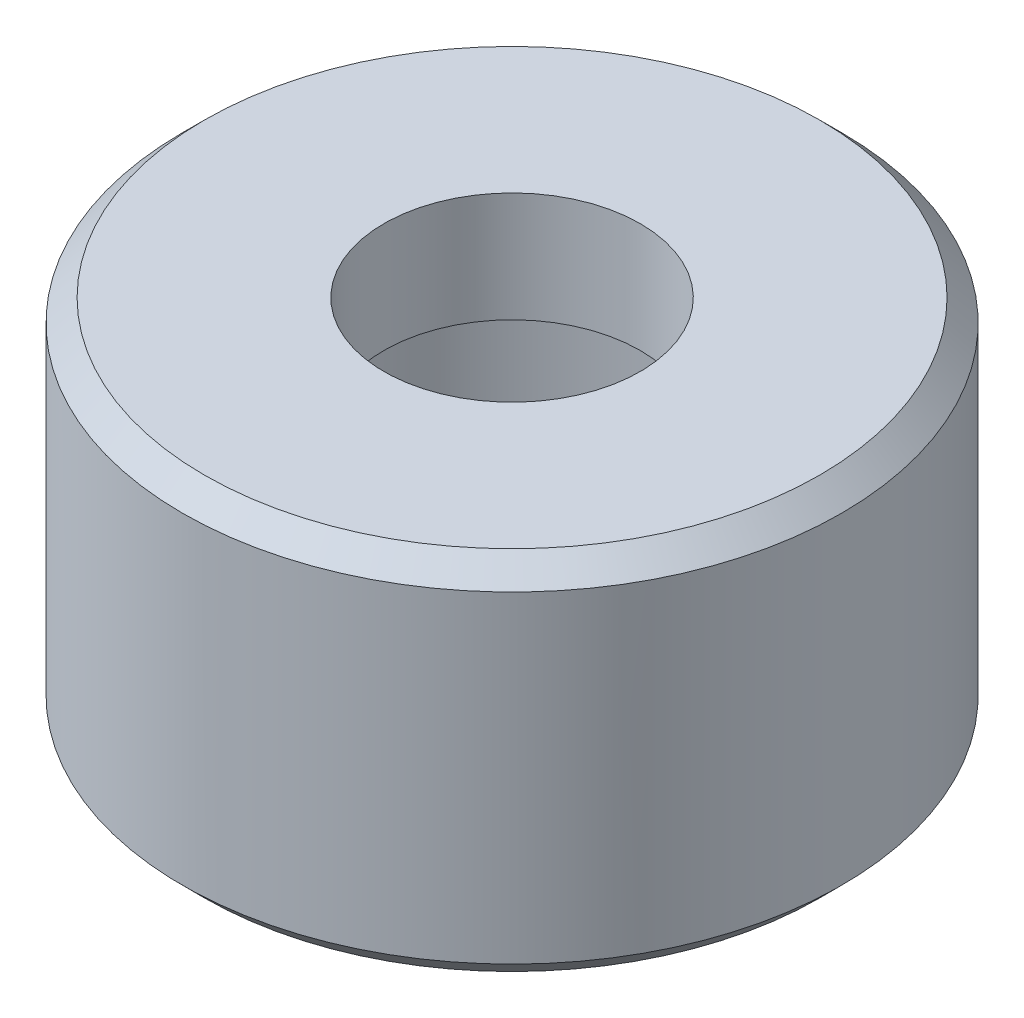
ISO-10303-21;
HEADER;
FILE_DESCRIPTION(('STEP AP214'),'2;1');
FILE_NAME('part.step','',(''),(''),'','','');
FILE_SCHEMA(('AUTOMOTIVE_DESIGN { 1 0 10303 214 1 1 1 1 }'));
ENDSEC;
DATA;
#1=APPLICATION_CONTEXT('core data for automotive mechanical design processes');
#2=APPLICATION_PROTOCOL_DEFINITION('international standard','automotive_design',2000,#1);
#3=PRODUCT_CONTEXT('',#1,'mechanical');
#4=PRODUCT('Part','Part','',(#3));
#5=PRODUCT_RELATED_PRODUCT_CATEGORY('part','',(#4));
#6=PRODUCT_DEFINITION_FORMATION('','',#4);
#7=PRODUCT_DEFINITION_CONTEXT('part definition',#1,'design');
#8=PRODUCT_DEFINITION('design','',#6,#7);
#9=PRODUCT_DEFINITION_SHAPE('','',#8);
#10=(LENGTH_UNIT() NAMED_UNIT(*) SI_UNIT(.MILLI.,.METRE.));
#11=(NAMED_UNIT(*) PLANE_ANGLE_UNIT() SI_UNIT($,.RADIAN.));
#12=(NAMED_UNIT(*) SI_UNIT($,.STERADIAN.) SOLID_ANGLE_UNIT());
#13=UNCERTAINTY_MEASURE_WITH_UNIT(LENGTH_MEASURE(1.E-05),#10,'distance_accuracy_value','');
#14=(GEOMETRIC_REPRESENTATION_CONTEXT(3) GLOBAL_UNCERTAINTY_ASSIGNED_CONTEXT((#13)) GLOBAL_UNIT_ASSIGNED_CONTEXT((#10,
#11,#12)) REPRESENTATION_CONTEXT('',''));
#15=CARTESIAN_POINT('',(0.,0.,0.));
#16=DIRECTION('',(0.,0.,1.));
#17=DIRECTION('',(1.,0.,0.));
#18=AXIS2_PLACEMENT_3D('',#15,#16,#17);
#19=CARTESIAN_POINT('',(0.,5.,-4.5));
#20=DIRECTION('',(0.,1.,0.));
#21=DIRECTION('',(0.,0.,1.));
#22=AXIS2_PLACEMENT_3D('',#19,#20,#21);
#23=PLANE('',#22);
#24=CARTESIAN_POINT('',(0.,5.,0.));
#25=DIRECTION('',(0.,1.,0.));
#26=DIRECTION('',(0.,0.,1.));
#27=AXIS2_PLACEMENT_3D('',#24,#25,#26);
#28=CIRCLE('',#27,4.2);
#29=CARTESIAN_POINT('',(0.,5.,4.2));
#30=VERTEX_POINT('',#29);
#31=EDGE_CURVE('E10',#30,#30,#28,.T.);
#32=ORIENTED_EDGE('',*,*,#31,.T.);
#33=EDGE_LOOP('',(#32));
#34=FACE_BOUND('',#33,.T.);
#35=CARTESIAN_POINT('',(0.,5.,0.));
#36=DIRECTION('',(0.,-1.,0.));
#37=DIRECTION('',(0.,0.,-1.));
#38=AXIS2_PLACEMENT_3D('',#35,#36,#37);
#39=CIRCLE('',#38,1.75);
#40=CARTESIAN_POINT('',(0.,5.,-1.75));
#41=VERTEX_POINT('',#40);
#42=EDGE_CURVE('E56',#41,#41,#39,.T.);
#43=ORIENTED_EDGE('',*,*,#42,.T.);
#44=EDGE_LOOP('',(#43));
#45=FACE_BOUND('',#44,.T.);
#46=ADVANCED_FACE('F35',(#34,#45),#23,.T.);
#47=CARTESIAN_POINT('',(0.,0.,0.));
#48=DIRECTION('',(0.,-1.,0.));
#49=DIRECTION('',(0.,0.,-1.));
#50=AXIS2_PLACEMENT_3D('',#47,#48,#49);
#51=CYLINDRICAL_SURFACE('',#50,1.75);
#52=CARTESIAN_POINT('',(0.,3.5,0.));
#53=DIRECTION('',(0.,-1.,0.));
#54=DIRECTION('',(0.,0.,-1.));
#55=AXIS2_PLACEMENT_3D('',#52,#53,#54);
#56=CIRCLE('',#55,1.75);
#57=CARTESIAN_POINT('',(0.,3.5,-1.75));
#58=VERTEX_POINT('',#57);
#59=EDGE_CURVE('E59',#58,#58,#56,.T.);
#60=ORIENTED_EDGE('',*,*,#59,.T.);
#61=EDGE_LOOP('',(#60));
#62=FACE_BOUND('',#61,.T.);
#63=ORIENTED_EDGE('',*,*,#42,.F.);
#64=EDGE_LOOP('',(#63));
#65=FACE_BOUND('',#64,.T.);
#66=ADVANCED_FACE('F86',(#62,#65),#51,.F.);
#67=CARTESIAN_POINT('',(0.,3.5,-1.75));
#68=DIRECTION('',(0.,-1.,0.));
#69=DIRECTION('',(0.,0.,-1.));
#70=AXIS2_PLACEMENT_3D('',#67,#68,#69);
#71=PLANE('',#70);
#72=CARTESIAN_POINT('',(0.,3.5,0.));
#73=DIRECTION('',(0.,-1.,0.));
#74=DIRECTION('',(0.,0.,-1.));
#75=AXIS2_PLACEMENT_3D('',#72,#73,#74);
#76=CIRCLE('',#75,3.);
#77=CARTESIAN_POINT('',(0.,3.5,-3.));
#78=VERTEX_POINT('',#77);
#79=EDGE_CURVE('E62',#78,#78,#76,.T.);
#80=ORIENTED_EDGE('',*,*,#79,.T.);
#81=EDGE_LOOP('',(#80));
#82=FACE_BOUND('',#81,.T.);
#83=ORIENTED_EDGE('',*,*,#59,.F.);
#84=EDGE_LOOP('',(#83));
#85=FACE_BOUND('',#84,.T.);
#86=ADVANCED_FACE('F83',(#82,#85),#71,.T.);
#87=CARTESIAN_POINT('',(0.,0.,0.));
#88=DIRECTION('',(0.,-1.,0.));
#89=DIRECTION('',(0.,0.,-1.));
#90=AXIS2_PLACEMENT_3D('',#87,#88,#89);
#91=CYLINDRICAL_SURFACE('',#90,3.);
#92=CARTESIAN_POINT('',(0.,0.,0.));
#93=DIRECTION('',(0.,-1.,0.));
#94=DIRECTION('',(0.,0.,-1.));
#95=AXIS2_PLACEMENT_3D('',#92,#93,#94);
#96=CIRCLE('',#95,3.);
#97=CARTESIAN_POINT('',(0.,0.,-3.));
#98=VERTEX_POINT('',#97);
#99=EDGE_CURVE('E65',#98,#98,#96,.T.);
#100=ORIENTED_EDGE('',*,*,#99,.T.);
#101=EDGE_LOOP('',(#100));
#102=FACE_BOUND('',#101,.T.);
#103=ORIENTED_EDGE('',*,*,#79,.F.);
#104=EDGE_LOOP('',(#103));
#105=FACE_BOUND('',#104,.T.);
#106=ADVANCED_FACE('F69',(#102,#105),#91,.F.);
#107=CARTESIAN_POINT('',(0.,0.,-3.));
#108=DIRECTION('',(0.,-1.,0.));
#109=DIRECTION('',(0.,0.,-1.));
#110=AXIS2_PLACEMENT_3D('',#107,#108,#109);
#111=PLANE('',#110);
#112=CARTESIAN_POINT('',(0.,0.,0.));
#113=DIRECTION('',(0.,-1.,0.));
#114=DIRECTION('',(0.,0.,-1.));
#115=AXIS2_PLACEMENT_3D('',#112,#113,#114);
#116=CIRCLE('',#115,4.2);
#117=CARTESIAN_POINT('',(0.,0.,-4.2));
#118=VERTEX_POINT('',#117);
#119=EDGE_CURVE('E51',#118,#118,#116,.T.);
#120=ORIENTED_EDGE('',*,*,#119,.T.);
#121=EDGE_LOOP('',(#120));
#122=FACE_BOUND('',#121,.T.);
#123=ORIENTED_EDGE('',*,*,#99,.F.);
#124=EDGE_LOOP('',(#123));
#125=FACE_BOUND('',#124,.T.);
#126=ADVANCED_FACE('F72',(#122,#125),#111,.T.);
#127=CARTESIAN_POINT('',(0.,0.,0.));
#128=DIRECTION('',(0.,-1.,0.));
#129=DIRECTION('',(0.,0.,-1.));
#130=AXIS2_PLACEMENT_3D('',#127,#128,#129);
#131=CYLINDRICAL_SURFACE('',#130,4.5);
#132=CARTESIAN_POINT('',(0.,0.3,0.));
#133=DIRECTION('',(0.,-1.,0.));
#134=DIRECTION('',(0.,0.,-1.));
#135=AXIS2_PLACEMENT_3D('',#132,#133,#134);
#136=CIRCLE('',#135,4.5);
#137=CARTESIAN_POINT('',(0.,0.3,-4.5));
#138=VERTEX_POINT('',#137);
#139=EDGE_CURVE('E43',#138,#138,#136,.F.);
#140=ORIENTED_EDGE('',*,*,#139,.T.);
#141=EDGE_LOOP('',(#140));
#142=FACE_BOUND('',#141,.T.);
#143=CARTESIAN_POINT('',(0.,4.7,0.));
#144=DIRECTION('',(0.,1.,0.));
#145=DIRECTION('',(0.,0.,1.));
#146=AXIS2_PLACEMENT_3D('',#143,#144,#145);
#147=CIRCLE('',#146,4.5);
#148=CARTESIAN_POINT('',(0.,4.7,4.5));
#149=VERTEX_POINT('',#148);
#150=EDGE_CURVE('E47',#149,#149,#147,.F.);
#151=ORIENTED_EDGE('',*,*,#150,.T.);
#152=EDGE_LOOP('',(#151));
#153=FACE_BOUND('',#152,.T.);
#154=ADVANCED_FACE('F74',(#142,#153),#131,.T.);
#155=CARTESIAN_POINT('',(0.,0.,0.));
#156=DIRECTION('',(0.,1.,0.));
#157=DIRECTION('',(0.,0.,1.));
#158=AXIS2_PLACEMENT_3D('',#155,#156,#157);
#159=CONICAL_SURFACE('',#158,4.2,0.785398163397445);
#160=ORIENTED_EDGE('',*,*,#139,.F.);
#161=EDGE_LOOP('',(#160));
#162=FACE_BOUND('',#161,.T.);
#163=ORIENTED_EDGE('',*,*,#119,.F.);
#164=EDGE_LOOP('',(#163));
#165=FACE_BOUND('',#164,.T.);
#166=ADVANCED_FACE('F81',(#162,#165),#159,.T.);
#167=CARTESIAN_POINT('',(0.,4.7,0.));
#168=DIRECTION('',(0.,-1.,0.));
#169=DIRECTION('',(0.,0.,-1.));
#170=AXIS2_PLACEMENT_3D('',#167,#168,#169);
#171=CONICAL_SURFACE('',#170,4.5,0.78539816339745);
#172=ORIENTED_EDGE('',*,*,#31,.F.);
#173=EDGE_LOOP('',(#172));
#174=FACE_BOUND('',#173,.T.);
#175=ORIENTED_EDGE('',*,*,#150,.F.);
#176=EDGE_LOOP('',(#175));
#177=FACE_BOUND('',#176,.T.);
#178=ADVANCED_FACE('F38',(#174,#177),#171,.T.);
#179=CLOSED_SHELL('',(#46,#66,#86,#106,#126,#154,#166,#178));
#180=MANIFOLD_SOLID_BREP('B2',#179);
#181=ADVANCED_BREP_SHAPE_REPRESENTATION('',(#18,#180),#14);
#182=SHAPE_DEFINITION_REPRESENTATION(#9,#181);
ENDSEC;
END-ISO-10303-21;
